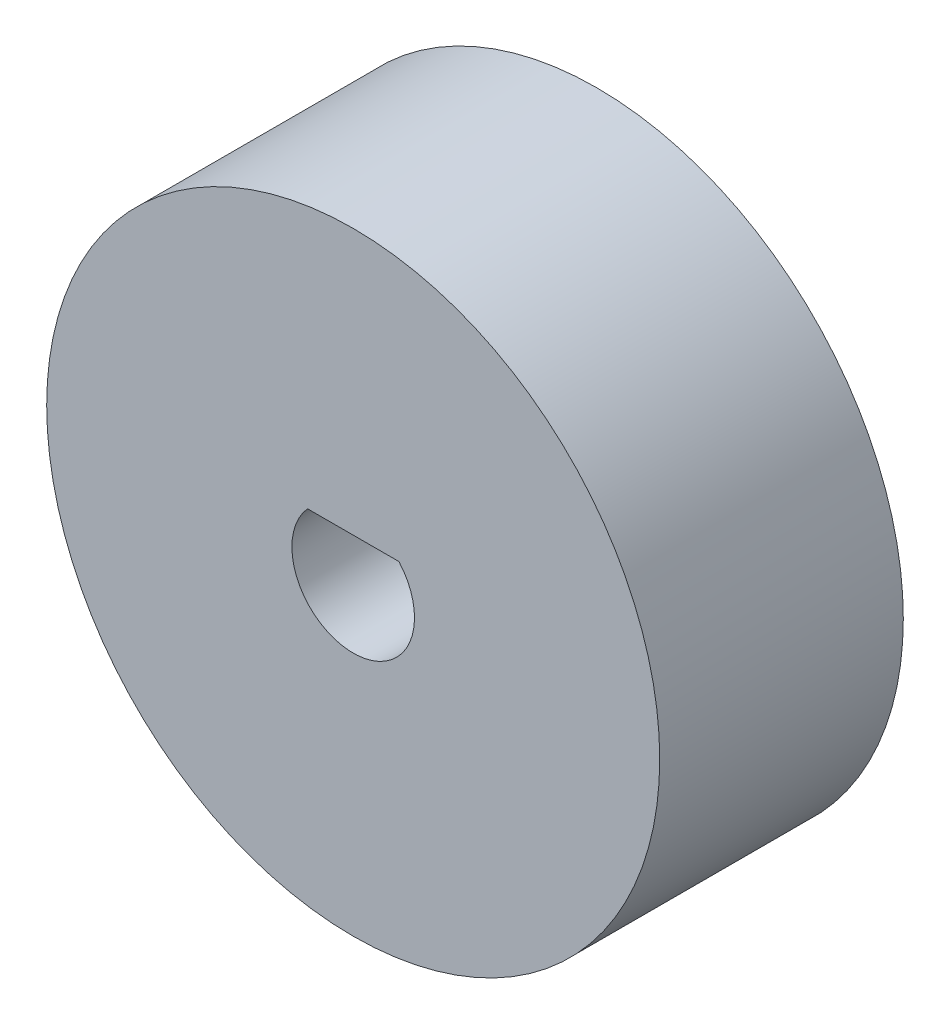
ISO-10303-21;
HEADER;
FILE_DESCRIPTION(('STEP AP214'),'2;1');
FILE_NAME('part.step','',(''),(''),'','','');
FILE_SCHEMA(('AUTOMOTIVE_DESIGN { 1 0 10303 214 1 1 1 1 }'));
ENDSEC;
DATA;
#1=APPLICATION_CONTEXT('core data for automotive mechanical design processes');
#2=APPLICATION_PROTOCOL_DEFINITION('international standard','automotive_design',2000,#1);
#3=PRODUCT_CONTEXT('',#1,'mechanical');
#4=PRODUCT('Part','Part','',(#3));
#5=PRODUCT_RELATED_PRODUCT_CATEGORY('part','',(#4));
#6=PRODUCT_DEFINITION_FORMATION('','',#4);
#7=PRODUCT_DEFINITION_CONTEXT('part definition',#1,'design');
#8=PRODUCT_DEFINITION('design','',#6,#7);
#9=PRODUCT_DEFINITION_SHAPE('','',#8);
#10=(LENGTH_UNIT() NAMED_UNIT(*) SI_UNIT(.MILLI.,.METRE.));
#11=(NAMED_UNIT(*) PLANE_ANGLE_UNIT() SI_UNIT($,.RADIAN.));
#12=(NAMED_UNIT(*) SI_UNIT($,.STERADIAN.) SOLID_ANGLE_UNIT());
#13=UNCERTAINTY_MEASURE_WITH_UNIT(LENGTH_MEASURE(1.E-05),#10,'distance_accuracy_value','');
#14=(GEOMETRIC_REPRESENTATION_CONTEXT(3) GLOBAL_UNCERTAINTY_ASSIGNED_CONTEXT((#13)) GLOBAL_UNIT_ASSIGNED_CONTEXT((#10,
#11,#12)) REPRESENTATION_CONTEXT('',''));
#15=CARTESIAN_POINT('',(0.,0.,0.));
#16=DIRECTION('',(0.,0.,1.));
#17=DIRECTION('',(1.,0.,0.));
#18=AXIS2_PLACEMENT_3D('',#15,#16,#17);
#19=CARTESIAN_POINT('',(0.,0.,2.98));
#20=DIRECTION('',(0.,0.,-1.));
#21=DIRECTION('',(-1.,0.,0.));
#22=AXIS2_PLACEMENT_3D('',#19,#20,#21);
#23=CYLINDRICAL_SURFACE('',#22,7.5);
#24=CARTESIAN_POINT('',(0.,0.,2.98));
#25=DIRECTION('',(0.,0.,1.));
#26=DIRECTION('',(1.,0.,0.));
#27=AXIS2_PLACEMENT_3D('',#24,#25,#26);
#28=CIRCLE('',#27,7.5);
#29=CARTESIAN_POINT('',(7.5,0.,2.98));
#30=VERTEX_POINT('',#29);
#31=EDGE_CURVE('E11',#30,#30,#28,.T.);
#32=ORIENTED_EDGE('',*,*,#31,.F.);
#33=EDGE_LOOP('',(#32));
#34=FACE_BOUND('',#33,.T.);
#35=CARTESIAN_POINT('',(0.,0.,-2.98));
#36=DIRECTION('',(0.,0.,1.));
#37=DIRECTION('',(1.,0.,0.));
#38=AXIS2_PLACEMENT_3D('',#35,#36,#37);
#39=CIRCLE('',#38,7.5);
#40=CARTESIAN_POINT('',(7.5,0.,-2.98));
#41=VERTEX_POINT('',#40);
#42=EDGE_CURVE('E42',#41,#41,#39,.T.);
#43=ORIENTED_EDGE('',*,*,#42,.T.);
#44=EDGE_LOOP('',(#43));
#45=FACE_BOUND('',#44,.T.);
#46=ADVANCED_FACE('F39',(#34,#45),#23,.T.);
#47=CARTESIAN_POINT('',(0.,0.,2.98));
#48=DIRECTION('',(0.,0.,1.));
#49=DIRECTION('',(1.,0.,0.));
#50=AXIS2_PLACEMENT_3D('',#47,#48,#49);
#51=PLANE('',#50);
#52=ORIENTED_EDGE('',*,*,#31,.T.);
#53=EDGE_LOOP('',(#52));
#54=FACE_BOUND('',#53,.T.);
#55=CARTESIAN_POINT('',(0.,0.,2.98));
#56=DIRECTION('',(0.,0.,1.));
#57=DIRECTION('',(1.,0.,0.));
#58=AXIS2_PLACEMENT_3D('',#55,#56,#57);
#59=CIRCLE('',#58,1.5);
#60=CARTESIAN_POINT('',(-1.11803398874989,1.,2.98));
#61=VERTEX_POINT('',#60);
#62=CARTESIAN_POINT('',(1.11803398874989,1.,2.98));
#63=VERTEX_POINT('',#62);
#64=EDGE_CURVE('E75',#61,#63,#59,.T.);
#65=ORIENTED_EDGE('',*,*,#64,.F.);
#66=DIRECTION('',(1.,0.,0.));
#67=VECTOR('',#66,1.);
#68=CARTESIAN_POINT('',(0.,1.,2.98));
#69=LINE('',#68,#67);
#70=EDGE_CURVE('E68',#61,#63,#69,.T.);
#71=ORIENTED_EDGE('',*,*,#70,.T.);
#72=EDGE_LOOP('',(#65,#71));
#73=FACE_BOUND('',#72,.T.);
#74=ADVANCED_FACE('F88',(#54,#73),#51,.T.);
#75=CARTESIAN_POINT('',(0.,0.,-2.98));
#76=DIRECTION('',(0.,0.,1.));
#77=DIRECTION('',(1.,0.,0.));
#78=AXIS2_PLACEMENT_3D('',#75,#76,#77);
#79=PLANE('',#78);
#80=ORIENTED_EDGE('',*,*,#42,.F.);
#81=EDGE_LOOP('',(#80));
#82=FACE_BOUND('',#81,.T.);
#83=DIRECTION('',(-1.,0.,0.));
#84=VECTOR('',#83,1.);
#85=CARTESIAN_POINT('',(0.,1.,-2.98));
#86=LINE('',#85,#84);
#87=CARTESIAN_POINT('',(1.11803398874989,1.,-2.98));
#88=VERTEX_POINT('',#87);
#89=CARTESIAN_POINT('',(-1.11803398874989,1.,-2.98));
#90=VERTEX_POINT('',#89);
#91=EDGE_CURVE('E66',#88,#90,#86,.T.);
#92=ORIENTED_EDGE('',*,*,#91,.T.);
#93=CARTESIAN_POINT('',(0.,0.,-2.98));
#94=DIRECTION('',(0.,0.,1.));
#95=DIRECTION('',(1.,0.,0.));
#96=AXIS2_PLACEMENT_3D('',#93,#94,#95);
#97=CIRCLE('',#96,1.5);
#98=EDGE_CURVE('E74',#88,#90,#97,.F.);
#99=ORIENTED_EDGE('',*,*,#98,.F.);
#100=EDGE_LOOP('',(#92,#99));
#101=FACE_BOUND('',#100,.T.);
#102=ADVANCED_FACE('F73',(#82,#101),#79,.F.);
#103=CARTESIAN_POINT('',(0.,0.,10.0510678118655));
#104=DIRECTION('',(0.,0.,-1.));
#105=DIRECTION('',(-1.,0.,0.));
#106=AXIS2_PLACEMENT_3D('',#103,#104,#105);
#107=CYLINDRICAL_SURFACE('',#106,1.5);
#108=DIRECTION('',(0.,0.,-1.));
#109=VECTOR('',#108,1.);
#110=CARTESIAN_POINT('',(-1.11803398874989,1.,10.0510678118655));
#111=LINE('',#110,#109);
#112=EDGE_CURVE('E60',#61,#90,#111,.T.);
#113=ORIENTED_EDGE('',*,*,#112,.F.);
#114=ORIENTED_EDGE('',*,*,#64,.T.);
#115=DIRECTION('',(0.,0.,-1.));
#116=VECTOR('',#115,1.);
#117=CARTESIAN_POINT('',(1.11803398874989,1.,10.0510678118655));
#118=LINE('',#117,#116);
#119=EDGE_CURVE('E53',#63,#88,#118,.T.);
#120=ORIENTED_EDGE('',*,*,#119,.T.);
#121=ORIENTED_EDGE('',*,*,#98,.T.);
#122=EDGE_LOOP('',(#113,#114,#120,#121));
#123=FACE_BOUND('',#122,.T.);
#124=ADVANCED_FACE('F77',(#123),#107,.F.);
#125=CARTESIAN_POINT('',(0.,1.,10.0510678118655));
#126=DIRECTION('',(0.,1.,0.));
#127=DIRECTION('',(0.,0.,1.));
#128=AXIS2_PLACEMENT_3D('',#125,#126,#127);
#129=PLANE('',#128);
#130=ORIENTED_EDGE('',*,*,#70,.F.);
#131=ORIENTED_EDGE('',*,*,#112,.T.);
#132=ORIENTED_EDGE('',*,*,#91,.F.);
#133=ORIENTED_EDGE('',*,*,#119,.F.);
#134=EDGE_LOOP('',(#130,#131,#132,#133));
#135=FACE_BOUND('',#134,.T.);
#136=ADVANCED_FACE('F65',(#135),#129,.F.);
#137=CLOSED_SHELL('',(#46,#74,#102,#124,#136));
#138=MANIFOLD_SOLID_BREP('B2',#137);
#139=ADVANCED_BREP_SHAPE_REPRESENTATION('',(#18,#138),#14);
#140=SHAPE_DEFINITION_REPRESENTATION(#9,#139);
ENDSEC;
END-ISO-10303-21;
